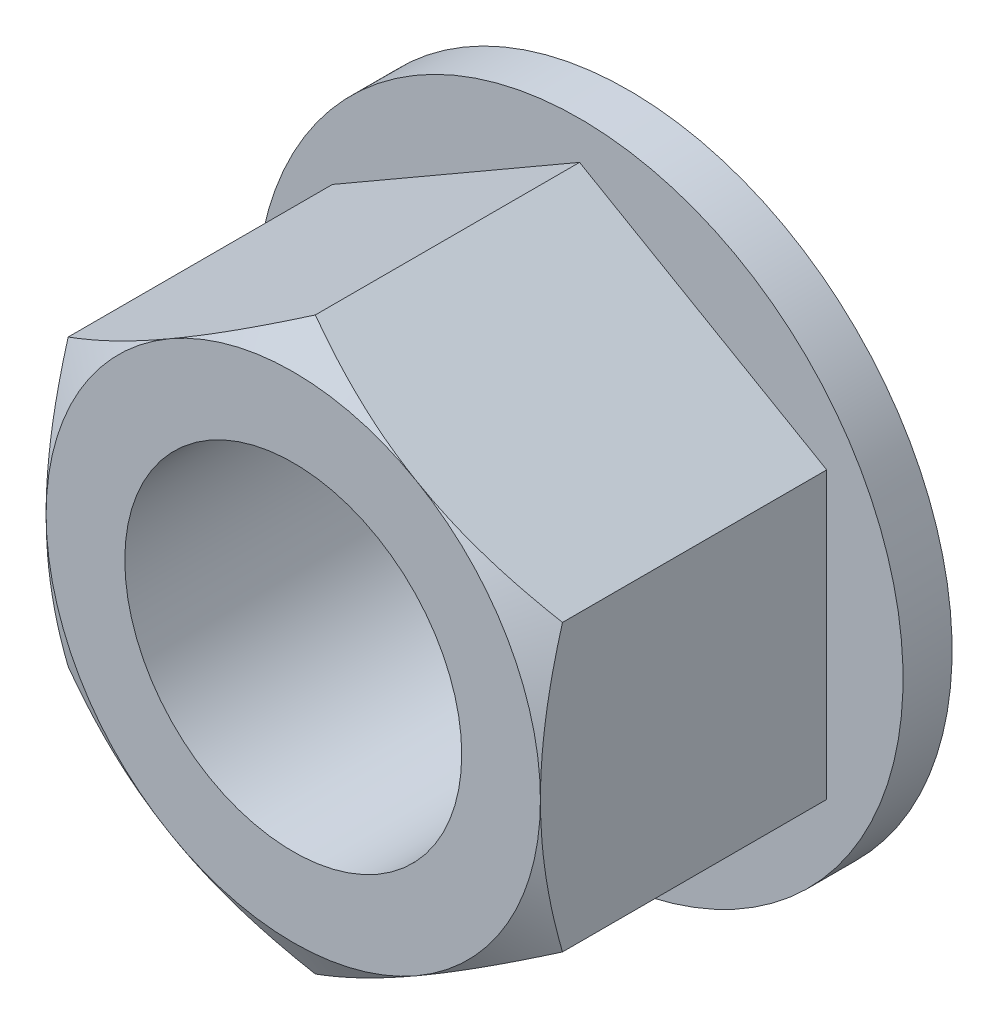
ISO-10303-21;
HEADER;
FILE_DESCRIPTION(('STEP AP214'),'2;1');
FILE_NAME('part.step','',(''),(''),'','','');
FILE_SCHEMA(('AUTOMOTIVE_DESIGN { 1 0 10303 214 1 1 1 1 }'));
ENDSEC;
DATA;
#1=APPLICATION_CONTEXT('core data for automotive mechanical design processes');
#2=APPLICATION_PROTOCOL_DEFINITION('international standard','automotive_design',2000,#1);
#3=PRODUCT_CONTEXT('',#1,'mechanical');
#4=PRODUCT('Part','Part','',(#3));
#5=PRODUCT_RELATED_PRODUCT_CATEGORY('part','',(#4));
#6=PRODUCT_DEFINITION_FORMATION('','',#4);
#7=PRODUCT_DEFINITION_CONTEXT('part definition',#1,'design');
#8=PRODUCT_DEFINITION('design','',#6,#7);
#9=PRODUCT_DEFINITION_SHAPE('','',#8);
#10=(LENGTH_UNIT() NAMED_UNIT(*) SI_UNIT(.MILLI.,.METRE.));
#11=(NAMED_UNIT(*) PLANE_ANGLE_UNIT() SI_UNIT($,.RADIAN.));
#12=(NAMED_UNIT(*) SI_UNIT($,.STERADIAN.) SOLID_ANGLE_UNIT());
#13=UNCERTAINTY_MEASURE_WITH_UNIT(LENGTH_MEASURE(1.E-05),#10,'distance_accuracy_value','');
#14=(GEOMETRIC_REPRESENTATION_CONTEXT(3) GLOBAL_UNCERTAINTY_ASSIGNED_CONTEXT((#13)) GLOBAL_UNIT_ASSIGNED_CONTEXT((#10,
#11,#12)) REPRESENTATION_CONTEXT('',''));
#15=CARTESIAN_POINT('',(0.,0.,0.));
#16=DIRECTION('',(0.,0.,1.));
#17=DIRECTION('',(1.,0.,0.));
#18=AXIS2_PLACEMENT_3D('',#15,#16,#17);
#19=CARTESIAN_POINT('',(0.,-4.58271776169265,2.6924));
#20=DIRECTION('',(-0.5,0.866025403784439,0.));
#21=DIRECTION('',(-0.866025403784439,-0.5,0.));
#22=AXIS2_PLACEMENT_3D('',#19,#20,#21);
#23=PLANE('',#22);
#24=DIRECTION('',(-0.866025403784439,-0.5,0.));
#25=VECTOR('',#24,1.);
#26=CARTESIAN_POINT('',(0.,-4.58271776169265,-1.905));
#27=LINE('',#26,#25);
#28=CARTESIAN_POINT('',(3.96875,-2.29135888084633,-1.905));
#29=VERTEX_POINT('',#28);
#30=CARTESIAN_POINT('',(0.,-4.58271776169265,-1.905));
#31=VERTEX_POINT('',#30);
#32=EDGE_CURVE('E57',#29,#31,#27,.T.);
#33=ORIENTED_EDGE('',*,*,#32,.F.);
#34=DIRECTION('',(0.,0.,-1.));
#35=VECTOR('',#34,1.);
#36=CARTESIAN_POINT('',(3.96875,-2.29135888084633,2.6924));
#37=LINE('',#36,#35);
#38=CARTESIAN_POINT('',(3.96875,-2.29135888084673,2.33792554751326));
#39=VERTEX_POINT('',#38);
#40=EDGE_CURVE('E362',#39,#29,#37,.T.);
#41=ORIENTED_EDGE('',*,*,#40,.F.);
#42=CARTESIAN_POINT('',(-0.000199999999999866,-4.58283323174649,2.33785887832671));
#43=CARTESIAN_POINT('',(0.174205902081157,-4.48213993723168,2.39601538164553));
#44=CARTESIAN_POINT('',(0.35011726598285,-4.38057746392952,2.44890651401833));
#45=CARTESIAN_POINT('',(0.704986056512738,-4.17569387219009,2.54122831645719));
#46=CARTESIAN_POINT('',(0.883949788458081,-4.07236911337627,2.58062632681341));
#47=CARTESIAN_POINT('',(1.23965934318176,-3.86700010620323,2.6419547964786));
#48=CARTESIAN_POINT('',(1.41635043707328,-3.76498745558155,2.66429343380879));
#49=CARTESIAN_POINT('',(1.7705639777928,-3.56048217249653,2.69096065750667));
#50=CARTESIAN_POINT('',(1.94808513722975,-3.45799028330875,2.69531132713073));
#51=CARTESIAN_POINT('',(2.27979074080338,-3.26647996379381,2.68625835025305));
#52=CARTESIAN_POINT('',(2.43402485076552,-3.17743285888894,2.67507751600782));
#53=CARTESIAN_POINT('',(2.74148824092523,-2.99991878781428,2.63964147944562));
#54=CARTESIAN_POINT('',(2.89471645773984,-2.91145243558892,2.61537417319011));
#55=CARTESIAN_POINT('',(3.20281373181354,-2.73357239146588,2.55470803864588));
#56=CARTESIAN_POINT('',(3.3576437962636,-2.64418121207699,2.51805205942136));
#57=CARTESIAN_POINT('',(3.66499472649982,-2.46673206976942,2.43485749862476));
#58=CARTESIAN_POINT('',(3.81751952962953,-2.37867183362439,2.38833846376704));
#59=CARTESIAN_POINT('',(3.96895,-2.29124341079249,2.33785887832671));
#60=B_SPLINE_CURVE_WITH_KNOTS('',3,(#42,#43,#44,#45,#46,#47,#48,#49,#50,#51,#52,#53,#54,#55,#56,
#57,#58,#59),.UNSPECIFIED.,.F.,.F.,(4,2,2,2,2,2,2,2,4),(0.,0.629094460519772,1.25970103886327,
1.87470051579826,2.48894475282133,3.02377031984306,3.55909140824994,4.1062865060967,
4.65240713705191),.UNSPECIFIED.);
#61=CARTESIAN_POINT('',(1.984375,-3.43703832126949,2.6924));
#62=VERTEX_POINT('',#61);
#63=EDGE_CURVE('E180',#62,#39,#60,.T.);
#64=ORIENTED_EDGE('',*,*,#63,.F.);
#65=CARTESIAN_POINT('',(0.,-4.58271776169265,2.337925547513));
#66=VERTEX_POINT('',#65);
#67=EDGE_CURVE('E384',#66,#62,#60,.T.);
#68=ORIENTED_EDGE('',*,*,#67,.F.);
#69=DIRECTION('',(0.,0.,-1.));
#70=VECTOR('',#69,1.);
#71=CARTESIAN_POINT('',(0.,-4.58271776169265,2.6924));
#72=LINE('',#71,#70);
#73=EDGE_CURVE('E126',#66,#31,#72,.T.);
#74=ORIENTED_EDGE('',*,*,#73,.T.);
#75=EDGE_LOOP('',(#33,#41,#64,#68,#74));
#76=FACE_BOUND('',#75,.T.);
#77=ADVANCED_FACE('F42',(#76),#23,.F.);
#78=CARTESIAN_POINT('',(3.96875,-2.29135888084633,2.6924));
#79=DIRECTION('',(-1.,0.,0.));
#80=DIRECTION('',(0.,0.,1.));
#81=AXIS2_PLACEMENT_3D('',#78,#79,#80);
#82=PLANE('',#81);
#83=DIRECTION('',(0.,-1.,0.));
#84=VECTOR('',#83,1.);
#85=CARTESIAN_POINT('',(3.96875,-2.29135888084633,-1.905));
#86=LINE('',#85,#84);
#87=CARTESIAN_POINT('',(3.96875,2.29135888084633,-1.905));
#88=VERTEX_POINT('',#87);
#89=EDGE_CURVE('E64',#88,#29,#86,.T.);
#90=ORIENTED_EDGE('',*,*,#89,.F.);
#91=DIRECTION('',(0.,0.,-1.));
#92=VECTOR('',#91,1.);
#93=CARTESIAN_POINT('',(3.96875,2.29135888084633,2.6924));
#94=LINE('',#93,#92);
#95=CARTESIAN_POINT('',(3.96875,2.29135888084633,2.337925547513));
#96=VERTEX_POINT('',#95);
#97=EDGE_CURVE('E358',#96,#88,#94,.T.);
#98=ORIENTED_EDGE('',*,*,#97,.F.);
#99=CARTESIAN_POINT('',(3.96875,-6.19084981294125,0.738070951943464));
#100=CARTESIAN_POINT('',(3.96875,-6.01714440765698,0.82247770249402));
#101=CARTESIAN_POINT('',(3.96875,-5.84304396996952,0.906085237896527));
#102=CARTESIAN_POINT('',(3.96875,-5.4938429743543,1.07125288912485));
#103=CARTESIAN_POINT('',(3.96875,-5.31874226701082,1.15281268870295));
#104=CARTESIAN_POINT('',(3.96875,-4.96644638631668,1.31383819248327));
#105=CARTESIAN_POINT('',(3.96875,-4.78924502241557,1.3932903989821));
#106=CARTESIAN_POINT('',(3.96875,-4.43344473670711,1.54898922575506));
#107=CARTESIAN_POINT('',(3.96875,-4.25484588049305,1.62523599542307));
#108=CARTESIAN_POINT('',(3.96875,-3.89018752485482,1.77606879080468));
#109=CARTESIAN_POINT('',(3.96875,-3.70407293455224,1.85052234440135));
#110=CARTESIAN_POINT('',(3.96875,-3.32968001498042,1.99388110068505));
#111=CARTESIAN_POINT('',(3.96875,-3.14140144774025,2.0627856863544));
#112=CARTESIAN_POINT('',(3.96875,-2.76272135048103,2.19326489146347));
#113=CARTESIAN_POINT('',(3.96875,-2.572324866455,2.25485401024147));
#114=CARTESIAN_POINT('',(3.96875,-2.18880157780611,2.36875035221158));
#115=CARTESIAN_POINT('',(3.96875,-1.99567564137067,2.42106045820059));
#116=CARTESIAN_POINT('',(3.96875,-1.60760068620995,2.51364810703483));
#117=CARTESIAN_POINT('',(3.96875,-1.41266694585759,2.55398851839733));
#118=CARTESIAN_POINT('',(3.96875,-1.02033927093273,2.6203596075806));
#119=CARTESIAN_POINT('',(3.96875,-0.822945601812595,2.64639181596543));
#120=CARTESIAN_POINT('',(3.96875,-0.429275865336236,2.68173098371571));
#121=CARTESIAN_POINT('',(3.96875,-0.233019846229611,2.69125576615999));
#122=CARTESIAN_POINT('',(3.96875,0.159603633534614,2.69334821380694));
#123=CARTESIAN_POINT('',(3.96875,0.355971097674928,2.68591531616485));
#124=CARTESIAN_POINT('',(3.96875,0.688185328805228,2.65952445572251));
#125=CARTESIAN_POINT('',(3.96875,0.824383730687385,2.64472941270721));
#126=CARTESIAN_POINT('',(3.96875,1.09580185143215,2.60788223742315));
#127=CARTESIAN_POINT('',(3.96875,1.2310214399412,2.58582915609698));
#128=CARTESIAN_POINT('',(3.96875,1.63501222231289,2.50994044862391));
#129=CARTESIAN_POINT('',(3.96875,1.90197938489316,2.44638761676705));
#130=CARTESIAN_POINT('',(3.96875,2.30141442653746,2.33590600865078));
#131=CARTESIAN_POINT('',(3.96875,2.43594223045768,2.29599909380506));
#132=CARTESIAN_POINT('',(3.96875,2.70369049859343,2.21197867385871));
#133=CARTESIAN_POINT('',(3.96875,2.83691095229628,2.16786513496225));
#134=CARTESIAN_POINT('',(3.96875,3.10208917185148,2.07614470683698));
#135=CARTESIAN_POINT('',(3.96875,3.23404729494471,2.0285388411157));
#136=CARTESIAN_POINT('',(3.96875,3.49686276562524,1.93040015101158));
#137=CARTESIAN_POINT('',(3.96875,3.62772014407167,1.87986740899837));
#138=CARTESIAN_POINT('',(3.96875,4.00268484088964,1.73102642361089));
#139=CARTESIAN_POINT('',(3.96875,4.24557257548592,1.62964786920729));
#140=CARTESIAN_POINT('',(3.96875,4.72868618177365,1.42071184150578));
#141=CARTESIAN_POINT('',(3.96875,4.96891168894292,1.31315353422333));
#142=CARTESIAN_POINT('',(3.96875,5.44737356943746,1.09343604718366));
#143=CARTESIAN_POINT('',(3.96875,5.6856089939969,0.981274808585412));
#144=CARTESIAN_POINT('',(3.96875,6.16042081642023,0.753537271568816));
#145=CARTESIAN_POINT('',(3.96875,6.39699729828146,0.637961147624123));
#146=CARTESIAN_POINT('',(3.96875,6.86926970043324,0.403980137884903));
#147=CARTESIAN_POINT('',(3.96875,7.10496329997826,0.285570577788118));
#148=CARTESIAN_POINT('',(3.96875,7.57530725974443,0.0466950689251643));
#149=CARTESIAN_POINT('',(3.96875,7.80995760884658,-0.073770901692391));
#150=CARTESIAN_POINT('',(3.96875,8.5125321590879,-0.437523955865884));
#151=CARTESIAN_POINT('',(3.96875,8.97920409176826,-0.683228346469193));
#152=CARTESIAN_POINT('',(3.96875,9.85610649938485,-1.14999274033718));
#153=CARTESIAN_POINT('',(3.96875,10.2665833857253,-1.37059202760493));
#154=CARTESIAN_POINT('',(3.96875,11.0862794633475,-1.81418605713858));
#155=CARTESIAN_POINT('',(3.96875,11.4954985594161,-2.03718097527368));
#156=CARTESIAN_POINT('',(3.96875,12.3115214833429,-2.48412580277454));
#157=CARTESIAN_POINT('',(3.96875,12.7183287240688,-2.70806949026852));
#158=CARTESIAN_POINT('',(3.96875,13.5311617001627,-3.15728628916723));
#159=CARTESIAN_POINT('',(3.96875,13.937187501662,-3.38255928086612));
#160=CARTESIAN_POINT('',(3.96875,14.3429448856149,-3.60831197070602));
#161=B_SPLINE_CURVE_WITH_KNOTS('',3,(#99,#100,#101,#102,#103,#104,#105,#106,#107,#108,#109,#110,
#111,#112,#113,#114,#115,#116,#117,#118,#119,#120,#121,#122,#123,#124,#125,#126,#127,#128,#129,
#130,#131,#132,#133,#134,#135,#136,#137,#138,#139,#140,#141,#142,#143,#144,#145,#146,#147,#148,
#149,#150,#151,#152,#153,#154,#155,#156,#157,#158,#159,#160),.UNSPECIFIED.,.F.,.F.,(4,2,2,2,2,2,
2,2,2,2,2,2,2,2,2,2,2,2,2,2,2,2,2,2,2,2,2,2,2,2,4),(0.,0.579388144655957,1.15886522506498,
1.74143466233807,2.32397691797782,2.92527175537604,3.52663336171841,4.1267824378276,
4.72674473224538,5.32349767024716,5.92018676050695,6.50894055188846,7.09771388496426,
7.50851445207789,7.91936875662055,8.74148530040073,9.16241485642126,9.58334779445593,
10.0041578573999,10.4249560834437,11.2144088066678,12.0039683213695,12.7938849310786,
13.5837612518424,14.3750452836595,15.1663377288891,16.7485059182377,18.1464959426069,
19.5445893079067,20.937707685457,22.3307024689662),.UNSPECIFIED.);
#162=CARTESIAN_POINT('',(3.96875,0.,2.6924));
#163=VERTEX_POINT('',#162);
#164=EDGE_CURVE('E205',#163,#96,#161,.T.);
#165=ORIENTED_EDGE('',*,*,#164,.F.);
#166=EDGE_CURVE('E385',#39,#163,#161,.T.);
#167=ORIENTED_EDGE('',*,*,#166,.F.);
#168=ORIENTED_EDGE('',*,*,#40,.T.);
#169=EDGE_LOOP('',(#90,#98,#165,#167,#168));
#170=FACE_BOUND('',#169,.T.);
#171=ADVANCED_FACE('F214',(#170),#82,.F.);
#172=CARTESIAN_POINT('',(3.96875,2.29135888084633,2.6924));
#173=DIRECTION('',(-0.5,-0.866025403784439,0.));
#174=DIRECTION('',(0.866025403784439,-0.5,0.));
#175=AXIS2_PLACEMENT_3D('',#172,#173,#174);
#176=PLANE('',#175);
#177=DIRECTION('',(0.866025403784439,-0.5,0.));
#178=VECTOR('',#177,1.);
#179=CARTESIAN_POINT('',(3.96875,2.29135888084633,-1.905));
#180=LINE('',#179,#178);
#181=CARTESIAN_POINT('',(0.,4.58271776169266,-1.905));
#182=VERTEX_POINT('',#181);
#183=EDGE_CURVE('E146',#182,#88,#180,.T.);
#184=ORIENTED_EDGE('',*,*,#183,.F.);
#185=DIRECTION('',(0.,0.,-1.));
#186=VECTOR('',#185,1.);
#187=CARTESIAN_POINT('',(0.,4.58271776169266,2.6924));
#188=LINE('',#187,#186);
#189=CARTESIAN_POINT('',(0.,4.58271776169266,2.337925547513));
#190=VERTEX_POINT('',#189);
#191=EDGE_CURVE('E356',#190,#182,#188,.T.);
#192=ORIENTED_EDGE('',*,*,#191,.F.);
#193=CARTESIAN_POINT('',(3.96895,2.29124341079249,2.33785887832671));
#194=CARTESIAN_POINT('',(3.79454409791884,2.39193670530731,2.39601538164553));
#195=CARTESIAN_POINT('',(3.61863273401715,2.49349917860946,2.44890651401833));
#196=CARTESIAN_POINT('',(3.26376394348726,2.69838277034889,2.54122831645718));
#197=CARTESIAN_POINT('',(3.08480021154192,2.80170752916271,2.58062632681341));
#198=CARTESIAN_POINT('',(2.72909065681824,3.00707653633575,2.6419547964786));
#199=CARTESIAN_POINT('',(2.55239956292672,3.10908918695743,2.66429343380879));
#200=CARTESIAN_POINT('',(2.1981860222072,3.31359447004245,2.69096065750667));
#201=CARTESIAN_POINT('',(2.02066486277024,3.41608635923024,2.69531132713073));
#202=CARTESIAN_POINT('',(1.68895925919662,3.60759667874517,2.68625835025305));
#203=CARTESIAN_POINT('',(1.53472514923448,3.69664378365004,2.67507751600782));
#204=CARTESIAN_POINT('',(1.22726175907478,3.8741578547247,2.63964147944562));
#205=CARTESIAN_POINT('',(1.07403354226016,3.96262420695006,2.61537417319011));
#206=CARTESIAN_POINT('',(0.765936268186465,4.1405042510731,2.55470803864588));
#207=CARTESIAN_POINT('',(0.611106203736397,4.229895430462,2.51805205942136));
#208=CARTESIAN_POINT('',(0.303755273500179,4.40734457276956,2.43485749862476));
#209=CARTESIAN_POINT('',(0.151230470370472,4.49540480891459,2.38833846376703));
#210=CARTESIAN_POINT('',(-0.000199999999999856,4.58283323174649,2.33785887832671));
#211=B_SPLINE_CURVE_WITH_KNOTS('',3,(#193,#194,#195,#196,#197,#198,#199,#200,#201,#202,#203,
#204,#205,#206,#207,#208,#209,#210),.UNSPECIFIED.,.F.,.F.,(4,2,2,2,2,2,2,2,4),(0.,
0.629094460519772,1.25970103886327,1.87470051579826,2.48894475282133,3.02377031984306,
3.55909140824994,4.1062865060967,4.65240713705191),.UNSPECIFIED.);
#212=CARTESIAN_POINT('',(1.984375,3.43703832126949,2.6924));
#213=VERTEX_POINT('',#212);
#214=EDGE_CURVE('E197',#213,#190,#211,.T.);
#215=ORIENTED_EDGE('',*,*,#214,.F.);
#216=EDGE_CURVE('E203',#96,#213,#211,.T.);
#217=ORIENTED_EDGE('',*,*,#216,.F.);
#218=ORIENTED_EDGE('',*,*,#97,.T.);
#219=EDGE_LOOP('',(#184,#192,#215,#217,#218));
#220=FACE_BOUND('',#219,.T.);
#221=ADVANCED_FACE('F210',(#220),#176,.F.);
#222=CARTESIAN_POINT('',(0.,4.58271776169266,2.6924));
#223=DIRECTION('',(0.5,-0.866025403784439,0.));
#224=DIRECTION('',(0.866025403784439,0.5,0.));
#225=AXIS2_PLACEMENT_3D('',#222,#223,#224);
#226=PLANE('',#225);
#227=DIRECTION('',(0.866025403784439,0.5,0.));
#228=VECTOR('',#227,1.);
#229=CARTESIAN_POINT('',(0.,4.58271776169266,-1.905));
#230=LINE('',#229,#228);
#231=CARTESIAN_POINT('',(-3.96875,2.29135888084633,-1.905));
#232=VERTEX_POINT('',#231);
#233=EDGE_CURVE('E136',#232,#182,#230,.T.);
#234=ORIENTED_EDGE('',*,*,#233,.F.);
#235=DIRECTION('',(0.,0.,-1.));
#236=VECTOR('',#235,1.);
#237=CARTESIAN_POINT('',(-3.96875,2.29135888084633,2.6924));
#238=LINE('',#237,#236);
#239=CARTESIAN_POINT('',(-3.96875,2.29135888084633,2.337925547513));
#240=VERTEX_POINT('',#239);
#241=EDGE_CURVE('E125',#240,#232,#238,.T.);
#242=ORIENTED_EDGE('',*,*,#241,.F.);
#243=CARTESIAN_POINT('',(0.000200000000000095,4.58283323174649,2.33785887832671));
#244=CARTESIAN_POINT('',(-0.174205902081157,4.48213993723168,2.39601538164553));
#245=CARTESIAN_POINT('',(-0.35011726598285,4.38057746392952,2.44890651401833));
#246=CARTESIAN_POINT('',(-0.704986056512737,4.17569387219009,2.54122831645718));
#247=CARTESIAN_POINT('',(-0.883949788458082,4.07236911337627,2.58062632681341));
#248=CARTESIAN_POINT('',(-1.23965934318176,3.86700010620323,2.6419547964786));
#249=CARTESIAN_POINT('',(-1.41635043707328,3.76498745558155,2.66429343380879));
#250=CARTESIAN_POINT('',(-1.7705639777928,3.56048217249653,2.69096065750667));
#251=CARTESIAN_POINT('',(-1.94808513722975,3.45799028330875,2.69531132713073));
#252=CARTESIAN_POINT('',(-2.27979074080338,3.26647996379381,2.68625835025305));
#253=CARTESIAN_POINT('',(-2.43402485076552,3.17743285888894,2.67507751600782));
#254=CARTESIAN_POINT('',(-2.74148824092523,2.99991878781428,2.63964147944562));
#255=CARTESIAN_POINT('',(-2.89471645773984,2.91145243558892,2.61537417319011));
#256=CARTESIAN_POINT('',(-3.20281373181354,2.73357239146588,2.55470803864588));
#257=CARTESIAN_POINT('',(-3.3576437962636,2.64418121207699,2.51805205942136));
#258=CARTESIAN_POINT('',(-3.66499472649982,2.46673206976943,2.43485749862476));
#259=CARTESIAN_POINT('',(-3.81751952962953,2.37867183362439,2.38833846376703));
#260=CARTESIAN_POINT('',(-3.96895,2.29124341079249,2.33785887832671));
#261=B_SPLINE_CURVE_WITH_KNOTS('',3,(#243,#244,#245,#246,#247,#248,#249,#250,#251,#252,#253,
#254,#255,#256,#257,#258,#259,#260),.UNSPECIFIED.,.F.,.F.,(4,2,2,2,2,2,2,2,4),(0.,
0.629094460519772,1.25970103886327,1.87470051579827,2.48894475282133,3.02377031984306,
3.55909140824994,4.1062865060967,4.65240713705191),.UNSPECIFIED.);
#262=CARTESIAN_POINT('',(-1.984375,3.43703832126949,2.6924));
#263=VERTEX_POINT('',#262);
#264=EDGE_CURVE('E190',#263,#240,#261,.T.);
#265=ORIENTED_EDGE('',*,*,#264,.F.);
#266=EDGE_CURVE('E204',#190,#263,#261,.T.);
#267=ORIENTED_EDGE('',*,*,#266,.F.);
#268=ORIENTED_EDGE('',*,*,#191,.T.);
#269=EDGE_LOOP('',(#234,#242,#265,#267,#268));
#270=FACE_BOUND('',#269,.T.);
#271=ADVANCED_FACE('F213',(#270),#226,.F.);
#272=CARTESIAN_POINT('',(-3.96875,2.29135888084633,2.6924));
#273=DIRECTION('',(1.,0.,0.));
#274=DIRECTION('',(0.,0.,-1.));
#275=AXIS2_PLACEMENT_3D('',#272,#273,#274);
#276=PLANE('',#275);
#277=DIRECTION('',(0.,1.,0.));
#278=VECTOR('',#277,1.);
#279=CARTESIAN_POINT('',(-3.96875,2.29135888084633,-1.905));
#280=LINE('',#279,#278);
#281=CARTESIAN_POINT('',(-3.96875,-2.29135888084633,-1.905));
#282=VERTEX_POINT('',#281);
#283=EDGE_CURVE('E130',#282,#232,#280,.T.);
#284=ORIENTED_EDGE('',*,*,#283,.F.);
#285=DIRECTION('',(0.,0.,-1.));
#286=VECTOR('',#285,1.);
#287=CARTESIAN_POINT('',(-3.96875,-2.29135888084633,2.6924));
#288=LINE('',#287,#286);
#289=CARTESIAN_POINT('',(-3.96875,-2.29135888084633,2.337925547513));
#290=VERTEX_POINT('',#289);
#291=EDGE_CURVE('E116',#290,#282,#288,.T.);
#292=ORIENTED_EDGE('',*,*,#291,.F.);
#293=CARTESIAN_POINT('',(-3.96875,-6.19084981294125,0.738070951943465));
#294=CARTESIAN_POINT('',(-3.96875,-6.01714440765698,0.82247770249402));
#295=CARTESIAN_POINT('',(-3.96875,-5.84304396996951,0.906085237896527));
#296=CARTESIAN_POINT('',(-3.96875,-5.4938429743543,1.07125288912485));
#297=CARTESIAN_POINT('',(-3.96875,-5.31874226701082,1.15281268870295));
#298=CARTESIAN_POINT('',(-3.96875,-4.96644638631668,1.31383819248327));
#299=CARTESIAN_POINT('',(-3.96875,-4.78924502241557,1.3932903989821));
#300=CARTESIAN_POINT('',(-3.96875,-4.43344473670711,1.54898922575506));
#301=CARTESIAN_POINT('',(-3.96875,-4.25484588049304,1.62523599542307));
#302=CARTESIAN_POINT('',(-3.96875,-3.89018752485481,1.77606879080468));
#303=CARTESIAN_POINT('',(-3.96875,-3.70407293455224,1.85052234440135));
#304=CARTESIAN_POINT('',(-3.96875,-3.32968001498041,1.99388110068505));
#305=CARTESIAN_POINT('',(-3.96875,-3.14140144774025,2.0627856863544));
#306=CARTESIAN_POINT('',(-3.96875,-2.76272135048103,2.19326489146347));
#307=CARTESIAN_POINT('',(-3.96875,-2.572324866455,2.25485401024148));
#308=CARTESIAN_POINT('',(-3.96875,-2.18880157780611,2.36875035221158));
#309=CARTESIAN_POINT('',(-3.96875,-1.99567564137067,2.42106045820059));
#310=CARTESIAN_POINT('',(-3.96875,-1.60760068620995,2.51364810703483));
#311=CARTESIAN_POINT('',(-3.96875,-1.41266694585758,2.55398851839733));
#312=CARTESIAN_POINT('',(-3.96875,-1.02033927093273,2.6203596075806));
#313=CARTESIAN_POINT('',(-3.96875,-0.822945601812593,2.64639181596543));
#314=CARTESIAN_POINT('',(-3.96875,-0.429275865336234,2.68173098371571));
#315=CARTESIAN_POINT('',(-3.96875,-0.233019846229609,2.69125576615999));
#316=CARTESIAN_POINT('',(-3.96875,0.159603633534617,2.69334821380694));
#317=CARTESIAN_POINT('',(-3.96875,0.355971097674931,2.68591531616485));
#318=CARTESIAN_POINT('',(-3.96875,0.688185328805231,2.65952445572251));
#319=CARTESIAN_POINT('',(-3.96875,0.824383730687388,2.64472941270721));
#320=CARTESIAN_POINT('',(-3.96875,1.09580185143215,2.60788223742315));
#321=CARTESIAN_POINT('',(-3.96875,1.2310214399412,2.58582915609698));
#322=CARTESIAN_POINT('',(-3.96875,1.63501222231289,2.50994044862391));
#323=CARTESIAN_POINT('',(-3.96875,1.90197938489316,2.44638761676705));
#324=CARTESIAN_POINT('',(-3.96875,2.30141442653746,2.33590600865078));
#325=CARTESIAN_POINT('',(-3.96875,2.43594223045769,2.29599909380505));
#326=CARTESIAN_POINT('',(-3.96875,2.70369049859344,2.2119786738587));
#327=CARTESIAN_POINT('',(-3.96875,2.83691095229628,2.16786513496224));
#328=CARTESIAN_POINT('',(-3.96875,3.10208917185149,2.07614470683698));
#329=CARTESIAN_POINT('',(-3.96875,3.23404729494471,2.0285388411157));
#330=CARTESIAN_POINT('',(-3.96875,3.49686276562524,1.93040015101158));
#331=CARTESIAN_POINT('',(-3.96875,3.62772014407168,1.87986740899836));
#332=CARTESIAN_POINT('',(-3.96875,4.00268484088964,1.73102642361089));
#333=CARTESIAN_POINT('',(-3.96875,4.24557257548593,1.62964786920729));
#334=CARTESIAN_POINT('',(-3.96875,4.72868618177366,1.42071184150578));
#335=CARTESIAN_POINT('',(-3.96875,4.96891168894293,1.31315353422333));
#336=CARTESIAN_POINT('',(-3.96875,5.44737356943747,1.09343604718366));
#337=CARTESIAN_POINT('',(-3.96875,5.6856089939969,0.98127480858541));
#338=CARTESIAN_POINT('',(-3.96875,6.16042081642024,0.753537271568814));
#339=CARTESIAN_POINT('',(-3.96875,6.39699729828146,0.63796114762412));
#340=CARTESIAN_POINT('',(-3.96875,6.86926970043324,0.403980137884901));
#341=CARTESIAN_POINT('',(-3.96875,7.10496329997826,0.285570577788116));
#342=CARTESIAN_POINT('',(-3.96875,7.57530725974443,0.0466950689251621));
#343=CARTESIAN_POINT('',(-3.96875,7.80995760884658,-0.0737709016923932));
#344=CARTESIAN_POINT('',(-3.96875,8.51253215908791,-0.437523955865886));
#345=CARTESIAN_POINT('',(-3.96875,8.97920409176827,-0.683228346469196));
#346=CARTESIAN_POINT('',(-3.96875,9.85610649938486,-1.14999274033719));
#347=CARTESIAN_POINT('',(-3.96875,10.2665833857253,-1.37059202760493));
#348=CARTESIAN_POINT('',(-3.96875,11.0862794633475,-1.81418605713858));
#349=CARTESIAN_POINT('',(-3.96875,11.4954985594161,-2.03718097527368));
#350=CARTESIAN_POINT('',(-3.96875,12.3115214833429,-2.48412580277454));
#351=CARTESIAN_POINT('',(-3.96875,12.7183287240688,-2.70806949026852));
#352=CARTESIAN_POINT('',(-3.96875,13.5311617001627,-3.15728628916723));
#353=CARTESIAN_POINT('',(-3.96875,13.9371875016621,-3.38255928086613));
#354=CARTESIAN_POINT('',(-3.96875,14.342944885615,-3.60831197070602));
#355=B_SPLINE_CURVE_WITH_KNOTS('',3,(#293,#294,#295,#296,#297,#298,#299,#300,#301,#302,#303,
#304,#305,#306,#307,#308,#309,#310,#311,#312,#313,#314,#315,#316,#317,#318,#319,#320,#321,#322,
#323,#324,#325,#326,#327,#328,#329,#330,#331,#332,#333,#334,#335,#336,#337,#338,#339,#340,#341,
#342,#343,#344,#345,#346,#347,#348,#349,#350,#351,#352,#353,#354),.UNSPECIFIED.,.F.,.F.,(4,2,2,
2,2,2,2,2,2,2,2,2,2,2,2,2,2,2,2,2,2,2,2,2,2,2,2,2,2,2,4),(0.,0.579388144655958,1.15886522506499,
1.74143466233807,2.32397691797782,2.92527175537604,3.52663336171841,4.12678243782761,
4.72674473224538,5.32349767024716,5.92018676050695,6.50894055188846,7.09771388496426,
7.50851445207789,7.91936875662055,8.74148530040073,9.16241485642126,9.58334779445593,
10.0041578573999,10.4249560834437,11.2144088066678,12.0039683213695,12.7938849310786,
13.5837612518424,14.3750452836595,15.1663377288891,16.7485059182377,18.1464959426069,
19.5445893079067,20.9377076854571,22.3307024689662),.UNSPECIFIED.);
#356=CARTESIAN_POINT('',(-3.96875,0.,2.6924));
#357=VERTEX_POINT('',#356);
#358=EDGE_CURVE('E157',#357,#290,#355,.F.);
#359=ORIENTED_EDGE('',*,*,#358,.F.);
#360=EDGE_CURVE('E394',#240,#357,#355,.F.);
#361=ORIENTED_EDGE('',*,*,#360,.F.);
#362=ORIENTED_EDGE('',*,*,#241,.T.);
#363=EDGE_LOOP('',(#284,#292,#359,#361,#362));
#364=FACE_BOUND('',#363,.T.);
#365=ADVANCED_FACE('F131',(#364),#276,.F.);
#366=CARTESIAN_POINT('',(-3.96875,-2.29135888084633,2.6924));
#367=DIRECTION('',(0.5,0.866025403784439,0.));
#368=DIRECTION('',(-0.866025403784439,0.5,0.));
#369=AXIS2_PLACEMENT_3D('',#366,#367,#368);
#370=PLANE('',#369);
#371=DIRECTION('',(-0.866025403784439,0.5,0.));
#372=VECTOR('',#371,1.);
#373=CARTESIAN_POINT('',(-3.96875,-2.29135888084633,-1.905));
#374=LINE('',#373,#372);
#375=EDGE_CURVE('E12',#31,#282,#374,.T.);
#376=ORIENTED_EDGE('',*,*,#375,.F.);
#377=ORIENTED_EDGE('',*,*,#73,.F.);
#378=CARTESIAN_POINT('',(-3.96895,-2.29124341079249,2.33785887832671));
#379=CARTESIAN_POINT('',(-3.79454409791884,-2.3919367053073,2.39601538164553));
#380=CARTESIAN_POINT('',(-3.61863273401715,-2.49349917860946,2.44890651401833));
#381=CARTESIAN_POINT('',(-3.26376394348726,-2.69838277034889,2.54122831645719));
#382=CARTESIAN_POINT('',(-3.08480021154192,-2.80170752916271,2.58062632681341));
#383=CARTESIAN_POINT('',(-2.72909065681824,-3.00707653633575,2.6419547964786));
#384=CARTESIAN_POINT('',(-2.55239956292672,-3.10908918695743,2.66429343380879));
#385=CARTESIAN_POINT('',(-2.1981860222072,-3.31359447004245,2.69096065750667));
#386=CARTESIAN_POINT('',(-2.02066486277025,-3.41608635923023,2.69531132713073));
#387=CARTESIAN_POINT('',(-1.68895925919662,-3.60759667874517,2.68625835025305));
#388=CARTESIAN_POINT('',(-1.53472514923448,-3.69664378365004,2.67507751600782));
#389=CARTESIAN_POINT('',(-1.22726175907478,-3.8741578547247,2.63964147944563));
#390=CARTESIAN_POINT('',(-1.07403354226016,-3.96262420695006,2.61537417319011));
#391=CARTESIAN_POINT('',(-0.765936268186465,-4.1405042510731,2.55470803864589));
#392=CARTESIAN_POINT('',(-0.611106203736397,-4.22989543046199,2.51805205942136));
#393=CARTESIAN_POINT('',(-0.303755273500179,-4.40734457276956,2.43485749862476));
#394=CARTESIAN_POINT('',(-0.151230470370471,-4.49540480891459,2.38833846376704));
#395=CARTESIAN_POINT('',(0.000200000000000602,-4.58283323174649,2.33785887832671));
#396=B_SPLINE_CURVE_WITH_KNOTS('',3,(#378,#379,#380,#381,#382,#383,#384,#385,#386,#387,#388,
#389,#390,#391,#392,#393,#394,#395),.UNSPECIFIED.,.F.,.F.,(4,2,2,2,2,2,2,2,4),(0.,
0.629094460519771,1.25970103886327,1.87470051579826,2.48894475282133,3.02377031984306,
3.55909140824994,4.1062865060967,4.65240713705191),.UNSPECIFIED.);
#397=CARTESIAN_POINT('',(-1.984375,-3.43703832126949,2.6924));
#398=VERTEX_POINT('',#397);
#399=EDGE_CURVE('E144',#398,#66,#396,.T.);
#400=ORIENTED_EDGE('',*,*,#399,.F.);
#401=EDGE_CURVE('E122',#290,#398,#396,.T.);
#402=ORIENTED_EDGE('',*,*,#401,.F.);
#403=ORIENTED_EDGE('',*,*,#291,.T.);
#404=EDGE_LOOP('',(#376,#377,#400,#402,#403));
#405=FACE_BOUND('',#404,.T.);
#406=ADVANCED_FACE('F118',(#405),#370,.F.);
#407=CARTESIAN_POINT('',(0.,0.,2.6924));
#408=DIRECTION('',(0.,0.,-1.));
#409=DIRECTION('',(1.,0.,0.));
#410=AXIS2_PLACEMENT_3D('',#407,#408,#409);
#411=CONICAL_SURFACE('',#410,3.96875,1.0471975511966);
#412=ORIENTED_EDGE('',*,*,#63,.T.);
#413=ORIENTED_EDGE('',*,*,#166,.T.);
#414=CARTESIAN_POINT('',(0.,0.,2.6924));
#415=DIRECTION('',(0.,0.,1.));
#416=DIRECTION('',(1.,0.,0.));
#417=AXIS2_PLACEMENT_3D('',#414,#415,#416);
#418=CIRCLE('',#417,3.96875);
#419=EDGE_CURVE('E366',#62,#163,#418,.T.);
#420=ORIENTED_EDGE('',*,*,#419,.F.);
#421=EDGE_LOOP('',(#412,#413,#420));
#422=FACE_BOUND('',#421,.T.);
#423=ADVANCED_FACE('F172',(#422),#411,.T.);
#424=ORIENTED_EDGE('',*,*,#67,.T.);
#425=EDGE_CURVE('E368',#398,#62,#418,.T.);
#426=ORIENTED_EDGE('',*,*,#425,.F.);
#427=ORIENTED_EDGE('',*,*,#399,.T.);
#428=EDGE_LOOP('',(#424,#426,#427));
#429=FACE_BOUND('',#428,.T.);
#430=ADVANCED_FACE('F166',(#429),#411,.T.);
#431=ORIENTED_EDGE('',*,*,#358,.T.);
#432=ORIENTED_EDGE('',*,*,#401,.T.);
#433=EDGE_CURVE('E373',#357,#398,#418,.T.);
#434=ORIENTED_EDGE('',*,*,#433,.F.);
#435=EDGE_LOOP('',(#431,#432,#434));
#436=FACE_BOUND('',#435,.T.);
#437=ADVANCED_FACE('F171',(#436),#411,.T.);
#438=ORIENTED_EDGE('',*,*,#264,.T.);
#439=ORIENTED_EDGE('',*,*,#360,.T.);
#440=EDGE_CURVE('E375',#263,#357,#418,.T.);
#441=ORIENTED_EDGE('',*,*,#440,.F.);
#442=EDGE_LOOP('',(#438,#439,#441));
#443=FACE_BOUND('',#442,.T.);
#444=ADVANCED_FACE('F393',(#443),#411,.T.);
#445=ORIENTED_EDGE('',*,*,#214,.T.);
#446=ORIENTED_EDGE('',*,*,#266,.T.);
#447=EDGE_CURVE('E50',#213,#263,#418,.T.);
#448=ORIENTED_EDGE('',*,*,#447,.F.);
#449=EDGE_LOOP('',(#445,#446,#448));
#450=FACE_BOUND('',#449,.T.);
#451=ADVANCED_FACE('F391',(#450),#411,.T.);
#452=ORIENTED_EDGE('',*,*,#164,.T.);
#453=ORIENTED_EDGE('',*,*,#216,.T.);
#454=CARTESIAN_POINT('',(0.,0.,2.6924));
#455=DIRECTION('',(0.,0.,1.));
#456=DIRECTION('',(1.,0.,0.));
#457=AXIS2_PLACEMENT_3D('',#454,#455,#456);
#458=CIRCLE('',#457,3.96875);
#459=EDGE_CURVE('E141',#163,#213,#458,.T.);
#460=ORIENTED_EDGE('',*,*,#459,.F.);
#461=EDGE_LOOP('',(#452,#453,#460));
#462=FACE_BOUND('',#461,.T.);
#463=ADVANCED_FACE('F231',(#462),#411,.T.);
#464=CARTESIAN_POINT('',(3.96875,-2.29135888084633,2.6924));
#465=DIRECTION('',(0.,0.,1.));
#466=DIRECTION('',(1.,0.,0.));
#467=AXIS2_PLACEMENT_3D('',#464,#465,#466);
#468=PLANE('',#467);
#469=CARTESIAN_POINT('',(0.,0.,2.6924));
#470=DIRECTION('',(0.,0.,1.));
#471=DIRECTION('',(1.,0.,0.));
#472=AXIS2_PLACEMENT_3D('',#469,#470,#471);
#473=CIRCLE('',#472,2.70509999999999);
#474=CARTESIAN_POINT('',(2.70509999999999,0.,2.6924));
#475=VERTEX_POINT('',#474);
#476=EDGE_CURVE('E344',#475,#475,#473,.T.);
#477=ORIENTED_EDGE('',*,*,#476,.F.);
#478=EDGE_LOOP('',(#477));
#479=FACE_BOUND('',#478,.T.);
#480=ORIENTED_EDGE('',*,*,#419,.T.);
#481=ORIENTED_EDGE('',*,*,#459,.T.);
#482=ORIENTED_EDGE('',*,*,#447,.T.);
#483=ORIENTED_EDGE('',*,*,#440,.T.);
#484=ORIENTED_EDGE('',*,*,#433,.T.);
#485=ORIENTED_EDGE('',*,*,#425,.T.);
#486=EDGE_LOOP('',(#480,#481,#482,#483,#484,#485));
#487=FACE_BOUND('',#486,.T.);
#488=ADVANCED_FACE('F176',(#479,#487),#468,.T.);
#489=CARTESIAN_POINT('',(0.,0.,-1.905));
#490=DIRECTION('',(0.,0.,-1.));
#491=DIRECTION('',(-1.,0.,0.));
#492=AXIS2_PLACEMENT_3D('',#489,#490,#491);
#493=PLANE('',#492);
#494=CARTESIAN_POINT('',(0.,0.,-1.905));
#495=DIRECTION('',(0.,0.,-1.));
#496=DIRECTION('',(-1.,0.,0.));
#497=AXIS2_PLACEMENT_3D('',#494,#495,#496);
#498=CIRCLE('',#497,5.1943);
#499=CARTESIAN_POINT('',(-5.1943,0.,-1.905));
#500=VERTEX_POINT('',#499);
#501=EDGE_CURVE('E137',#500,#500,#498,.T.);
#502=ORIENTED_EDGE('',*,*,#501,.F.);
#503=EDGE_LOOP('',(#502));
#504=FACE_BOUND('',#503,.T.);
#505=ORIENTED_EDGE('',*,*,#89,.T.);
#506=ORIENTED_EDGE('',*,*,#32,.T.);
#507=ORIENTED_EDGE('',*,*,#375,.T.);
#508=ORIENTED_EDGE('',*,*,#283,.T.);
#509=ORIENTED_EDGE('',*,*,#233,.T.);
#510=ORIENTED_EDGE('',*,*,#183,.T.);
#511=EDGE_LOOP('',(#505,#506,#507,#508,#509,#510));
#512=FACE_BOUND('',#511,.T.);
#513=ADVANCED_FACE('F139',(#504,#512),#493,.F.);
#514=CARTESIAN_POINT('',(0.,0.,-1.905));
#515=DIRECTION('',(0.,0.,-1.));
#516=DIRECTION('',(-1.,0.,0.));
#517=AXIS2_PLACEMENT_3D('',#514,#515,#516);
#518=CYLINDRICAL_SURFACE('',#517,5.1943);
#519=ORIENTED_EDGE('',*,*,#501,.T.);
#520=EDGE_LOOP('',(#519));
#521=FACE_BOUND('',#520,.T.);
#522=CARTESIAN_POINT('',(0.,0.,-2.6924));
#523=DIRECTION('',(0.,0.,-1.));
#524=DIRECTION('',(-1.,0.,0.));
#525=AXIS2_PLACEMENT_3D('',#522,#523,#524);
#526=CIRCLE('',#525,5.1943);
#527=CARTESIAN_POINT('',(-5.1943,0.,-2.6924));
#528=VERTEX_POINT('',#527);
#529=EDGE_CURVE('E346',#528,#528,#526,.T.);
#530=ORIENTED_EDGE('',*,*,#529,.F.);
#531=EDGE_LOOP('',(#530));
#532=FACE_BOUND('',#531,.T.);
#533=ADVANCED_FACE('F174',(#521,#532),#518,.T.);
#534=CARTESIAN_POINT('',(3.96875,-2.29135888084633,-2.6924));
#535=DIRECTION('',(0.,0.,1.));
#536=DIRECTION('',(1.,0.,0.));
#537=AXIS2_PLACEMENT_3D('',#534,#535,#536);
#538=PLANE('',#537);
#539=CARTESIAN_POINT('',(0.,0.,-2.6924));
#540=DIRECTION('',(0.,0.,1.));
#541=DIRECTION('',(1.,0.,0.));
#542=AXIS2_PLACEMENT_3D('',#539,#540,#541);
#543=CIRCLE('',#542,2.7051);
#544=CARTESIAN_POINT('',(2.7051,0.,-2.6924));
#545=VERTEX_POINT('',#544);
#546=EDGE_CURVE('E341',#545,#545,#543,.T.);
#547=ORIENTED_EDGE('',*,*,#546,.T.);
#548=EDGE_LOOP('',(#547));
#549=FACE_BOUND('',#548,.T.);
#550=ORIENTED_EDGE('',*,*,#529,.T.);
#551=EDGE_LOOP('',(#550));
#552=FACE_BOUND('',#551,.T.);
#553=ADVANCED_FACE('F281',(#549,#552),#538,.F.);
#554=CARTESIAN_POINT('',(0.,0.,2.6924));
#555=DIRECTION('',(0.,0.,1.));
#556=DIRECTION('',(1.,0.,0.));
#557=AXIS2_PLACEMENT_3D('',#554,#555,#556);
#558=CYLINDRICAL_SURFACE('',#557,2.70509999999999);
#559=ORIENTED_EDGE('',*,*,#546,.F.);
#560=EDGE_LOOP('',(#559));
#561=FACE_BOUND('',#560,.T.);
#562=ORIENTED_EDGE('',*,*,#476,.T.);
#563=EDGE_LOOP('',(#562));
#564=FACE_BOUND('',#563,.T.);
#565=ADVANCED_FACE('F299',(#561,#564),#558,.F.);
#566=CLOSED_SHELL('',(#77,#171,#221,#271,#365,#406,#423,#430,#437,#444,#451,#463,#488,#513,#533,
#553,#565));
#567=MANIFOLD_SOLID_BREP('B2',#566);
#568=ADVANCED_BREP_SHAPE_REPRESENTATION('',(#18,#567),#14);
#569=SHAPE_DEFINITION_REPRESENTATION(#9,#568);
ENDSEC;
END-ISO-10303-21;
